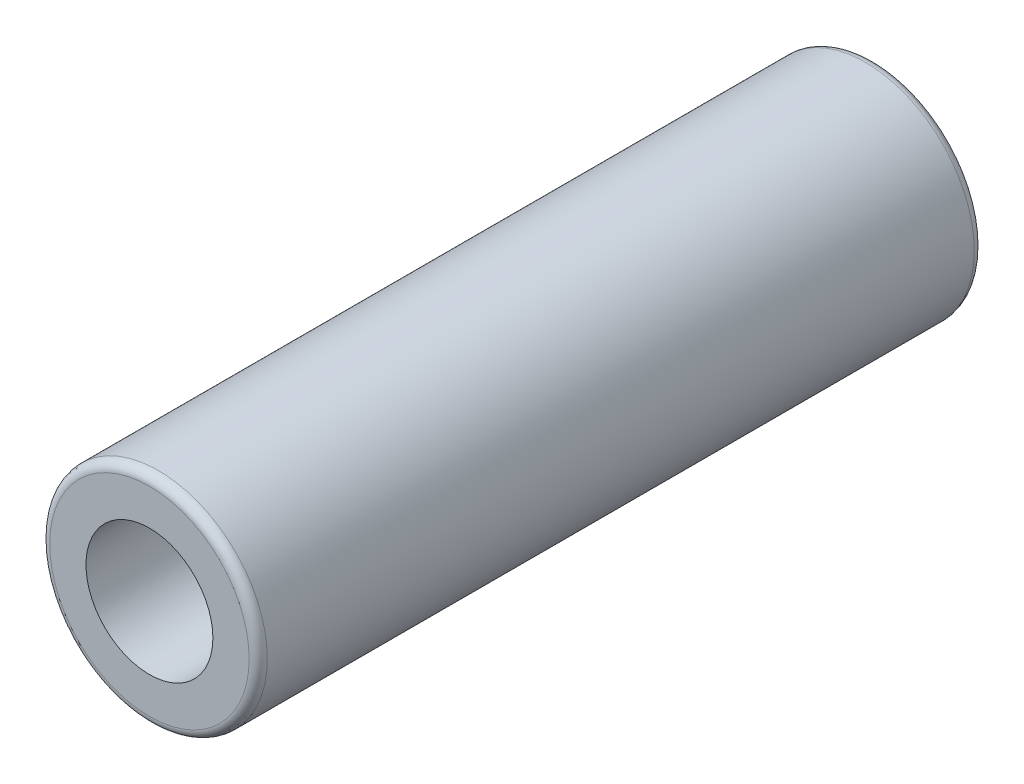
ISO-10303-21;
HEADER;
FILE_DESCRIPTION(('STEP AP214'),'2;1');
FILE_NAME('part.step','',(''),(''),'','','');
FILE_SCHEMA(('AUTOMOTIVE_DESIGN { 1 0 10303 214 1 1 1 1 }'));
ENDSEC;
DATA;
#1=APPLICATION_CONTEXT('core data for automotive mechanical design processes');
#2=APPLICATION_PROTOCOL_DEFINITION('international standard','automotive_design',2000,#1);
#3=PRODUCT_CONTEXT('',#1,'mechanical');
#4=PRODUCT('Part','Part','',(#3));
#5=PRODUCT_RELATED_PRODUCT_CATEGORY('part','',(#4));
#6=PRODUCT_DEFINITION_FORMATION('','',#4);
#7=PRODUCT_DEFINITION_CONTEXT('part definition',#1,'design');
#8=PRODUCT_DEFINITION('design','',#6,#7);
#9=PRODUCT_DEFINITION_SHAPE('','',#8);
#10=(LENGTH_UNIT() NAMED_UNIT(*) SI_UNIT(.MILLI.,.METRE.));
#11=(NAMED_UNIT(*) PLANE_ANGLE_UNIT() SI_UNIT($,.RADIAN.));
#12=(NAMED_UNIT(*) SI_UNIT($,.STERADIAN.) SOLID_ANGLE_UNIT());
#13=UNCERTAINTY_MEASURE_WITH_UNIT(LENGTH_MEASURE(1.E-05),#10,'distance_accuracy_value','');
#14=(GEOMETRIC_REPRESENTATION_CONTEXT(3) GLOBAL_UNCERTAINTY_ASSIGNED_CONTEXT((#13)) GLOBAL_UNIT_ASSIGNED_CONTEXT((#10,
#11,#12)) REPRESENTATION_CONTEXT('',''));
#15=CARTESIAN_POINT('',(0.,0.,0.));
#16=DIRECTION('',(0.,0.,1.));
#17=DIRECTION('',(1.,0.,0.));
#18=AXIS2_PLACEMENT_3D('',#15,#16,#17);
#19=CARTESIAN_POINT('',(0.,0.,40.));
#20=DIRECTION('',(0.,0.,1.));
#21=DIRECTION('',(1.,0.,0.));
#22=AXIS2_PLACEMENT_3D('',#19,#20,#21);
#23=PLANE('',#22);
#24=CARTESIAN_POINT('',(0.,0.,40.));
#25=DIRECTION('',(0.,0.,1.));
#26=DIRECTION('',(1.,0.,0.));
#27=AXIS2_PLACEMENT_3D('',#24,#25,#26);
#28=CIRCLE('',#27,5.5);
#29=CARTESIAN_POINT('',(5.5,0.,40.));
#30=VERTEX_POINT('',#29);
#31=EDGE_CURVE('E61',#30,#30,#28,.T.);
#32=ORIENTED_EDGE('',*,*,#31,.T.);
#33=EDGE_LOOP('',(#32));
#34=FACE_BOUND('',#33,.T.);
#35=CARTESIAN_POINT('',(0.,0.,40.));
#36=DIRECTION('',(0.,0.,1.));
#37=DIRECTION('',(1.,0.,0.));
#38=AXIS2_PLACEMENT_3D('',#35,#36,#37);
#39=CIRCLE('',#38,3.5);
#40=CARTESIAN_POINT('',(3.5,0.,40.));
#41=VERTEX_POINT('',#40);
#42=EDGE_CURVE('E67',#41,#41,#39,.T.);
#43=ORIENTED_EDGE('',*,*,#42,.F.);
#44=EDGE_LOOP('',(#43));
#45=FACE_BOUND('',#44,.T.);
#46=ADVANCED_FACE('F43',(#34,#45),#23,.T.);
#47=CARTESIAN_POINT('',(0.,0.,0.));
#48=DIRECTION('',(0.,0.,1.));
#49=DIRECTION('',(1.,0.,0.));
#50=AXIS2_PLACEMENT_3D('',#47,#48,#49);
#51=PLANE('',#50);
#52=CARTESIAN_POINT('',(0.,0.,0.));
#53=DIRECTION('',(0.,0.,1.));
#54=DIRECTION('',(1.,0.,0.));
#55=AXIS2_PLACEMENT_3D('',#52,#53,#54);
#56=CIRCLE('',#55,5.5);
#57=CARTESIAN_POINT('',(5.5,0.,0.));
#58=VERTEX_POINT('',#57);
#59=EDGE_CURVE('E10',#58,#58,#56,.F.);
#60=ORIENTED_EDGE('',*,*,#59,.T.);
#61=EDGE_LOOP('',(#60));
#62=FACE_BOUND('',#61,.T.);
#63=CARTESIAN_POINT('',(0.,0.,0.));
#64=DIRECTION('',(0.,0.,1.));
#65=DIRECTION('',(1.,0.,0.));
#66=AXIS2_PLACEMENT_3D('',#63,#64,#65);
#67=CIRCLE('',#66,3.5);
#68=CARTESIAN_POINT('',(3.5,0.,0.));
#69=VERTEX_POINT('',#68);
#70=EDGE_CURVE('E68',#69,#69,#67,.T.);
#71=ORIENTED_EDGE('',*,*,#70,.T.);
#72=EDGE_LOOP('',(#71));
#73=FACE_BOUND('',#72,.T.);
#74=ADVANCED_FACE('F80',(#62,#73),#51,.F.);
#75=CARTESIAN_POINT('',(0.,0.,40.));
#76=DIRECTION('',(0.,0.,-1.));
#77=DIRECTION('',(-1.,0.,0.));
#78=AXIS2_PLACEMENT_3D('',#75,#76,#77);
#79=CYLINDRICAL_SURFACE('',#78,6.);
#80=CARTESIAN_POINT('',(0.,0.,0.5));
#81=DIRECTION('',(0.,0.,1.));
#82=DIRECTION('',(1.,0.,0.));
#83=AXIS2_PLACEMENT_3D('',#80,#81,#82);
#84=CIRCLE('',#83,6.);
#85=CARTESIAN_POINT('',(6.,0.,0.5));
#86=VERTEX_POINT('',#85);
#87=EDGE_CURVE('E51',#86,#86,#84,.T.);
#88=ORIENTED_EDGE('',*,*,#87,.T.);
#89=EDGE_LOOP('',(#88));
#90=FACE_BOUND('',#89,.T.);
#91=CARTESIAN_POINT('',(0.,0.,39.5));
#92=DIRECTION('',(0.,0.,1.));
#93=DIRECTION('',(1.,0.,0.));
#94=AXIS2_PLACEMENT_3D('',#91,#92,#93);
#95=CIRCLE('',#94,6.);
#96=CARTESIAN_POINT('',(6.,0.,39.5));
#97=VERTEX_POINT('',#96);
#98=EDGE_CURVE('E56',#97,#97,#95,.F.);
#99=ORIENTED_EDGE('',*,*,#98,.T.);
#100=EDGE_LOOP('',(#99));
#101=FACE_BOUND('',#100,.T.);
#102=ADVANCED_FACE('F88',(#90,#101),#79,.T.);
#103=CARTESIAN_POINT('',(0.,0.,40.));
#104=DIRECTION('',(0.,0.,-1.));
#105=DIRECTION('',(-1.,0.,0.));
#106=AXIS2_PLACEMENT_3D('',#103,#104,#105);
#107=CYLINDRICAL_SURFACE('',#106,3.5);
#108=ORIENTED_EDGE('',*,*,#42,.T.);
#109=EDGE_LOOP('',(#108));
#110=FACE_BOUND('',#109,.T.);
#111=ORIENTED_EDGE('',*,*,#70,.F.);
#112=EDGE_LOOP('',(#111));
#113=FACE_BOUND('',#112,.T.);
#114=ADVANCED_FACE('F76',(#110,#113),#107,.F.);
#115=CARTESIAN_POINT('',(0.,0.,39.5));
#116=DIRECTION('',(0.,0.,1.));
#117=DIRECTION('',(1.,0.,0.));
#118=AXIS2_PLACEMENT_3D('',#115,#116,#117);
#119=TOROIDAL_SURFACE('',#118,5.5,0.5);
#120=ORIENTED_EDGE('',*,*,#98,.F.);
#121=EDGE_LOOP('',(#120));
#122=FACE_BOUND('',#121,.T.);
#123=ORIENTED_EDGE('',*,*,#31,.F.);
#124=EDGE_LOOP('',(#123));
#125=FACE_BOUND('',#124,.T.);
#126=ADVANCED_FACE('F93',(#122,#125),#119,.T.);
#127=CARTESIAN_POINT('',(0.,0.,0.5));
#128=DIRECTION('',(0.,0.,1.));
#129=DIRECTION('',(1.,0.,0.));
#130=AXIS2_PLACEMENT_3D('',#127,#128,#129);
#131=TOROIDAL_SURFACE('',#130,5.5,0.5);
#132=ORIENTED_EDGE('',*,*,#59,.F.);
#133=EDGE_LOOP('',(#132));
#134=FACE_BOUND('',#133,.T.);
#135=ORIENTED_EDGE('',*,*,#87,.F.);
#136=EDGE_LOOP('',(#135));
#137=FACE_BOUND('',#136,.T.);
#138=ADVANCED_FACE('F45',(#134,#137),#131,.T.);
#139=CLOSED_SHELL('',(#46,#74,#102,#114,#126,#138));
#140=MANIFOLD_SOLID_BREP('B2',#139);
#141=ADVANCED_BREP_SHAPE_REPRESENTATION('',(#18,#140),#14);
#142=SHAPE_DEFINITION_REPRESENTATION(#9,#141);
ENDSEC;
END-ISO-10303-21;
